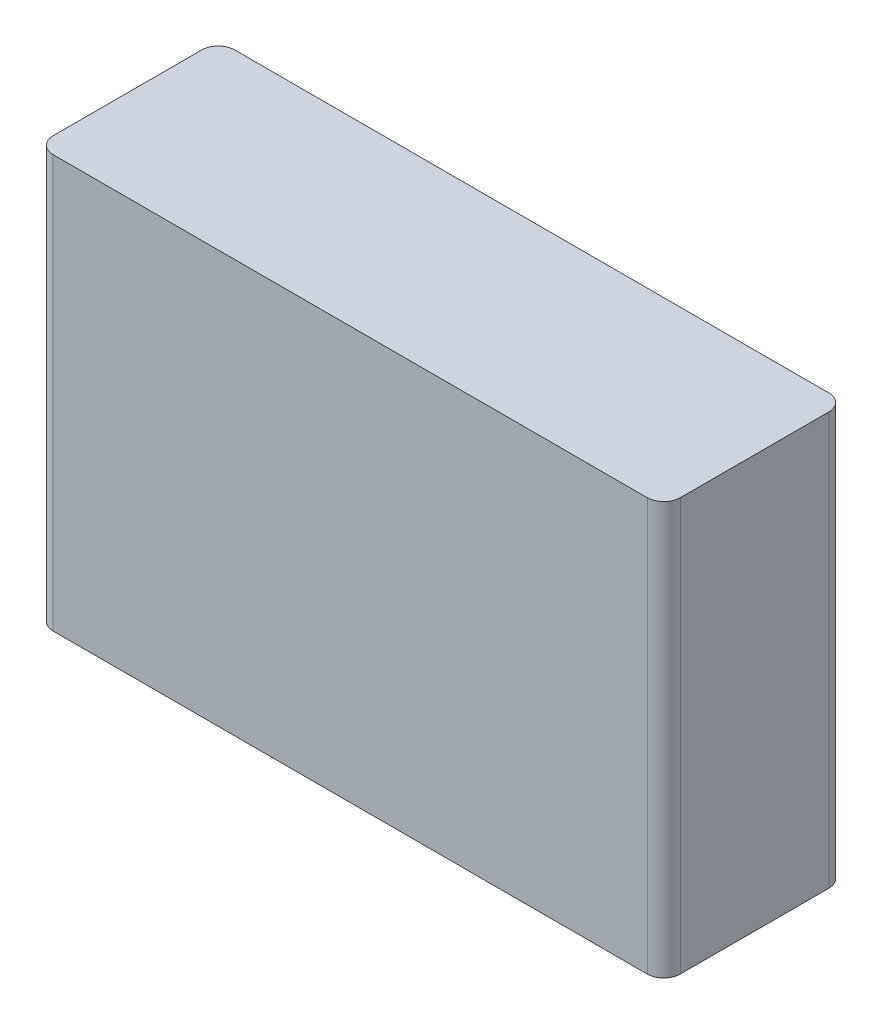
ISO-10303-21;
HEADER;
FILE_DESCRIPTION(('STEP AP214'),'2;1');
FILE_NAME('part.step','',(''),(''),'','','');
FILE_SCHEMA(('AUTOMOTIVE_DESIGN { 1 0 10303 214 1 1 1 1 }'));
ENDSEC;
DATA;
#1=APPLICATION_CONTEXT('core data for automotive mechanical design processes');
#2=APPLICATION_PROTOCOL_DEFINITION('international standard','automotive_design',2000,#1);
#3=PRODUCT_CONTEXT('',#1,'mechanical');
#4=PRODUCT('Part','Part','',(#3));
#5=PRODUCT_RELATED_PRODUCT_CATEGORY('part','',(#4));
#6=PRODUCT_DEFINITION_FORMATION('','',#4);
#7=PRODUCT_DEFINITION_CONTEXT('part definition',#1,'design');
#8=PRODUCT_DEFINITION('design','',#6,#7);
#9=PRODUCT_DEFINITION_SHAPE('','',#8);
#10=(LENGTH_UNIT() NAMED_UNIT(*) SI_UNIT(.MILLI.,.METRE.));
#11=(NAMED_UNIT(*) PLANE_ANGLE_UNIT() SI_UNIT($,.RADIAN.));
#12=(NAMED_UNIT(*) SI_UNIT($,.STERADIAN.) SOLID_ANGLE_UNIT());
#13=UNCERTAINTY_MEASURE_WITH_UNIT(LENGTH_MEASURE(1.E-05),#10,'distance_accuracy_value','');
#14=(GEOMETRIC_REPRESENTATION_CONTEXT(3) GLOBAL_UNCERTAINTY_ASSIGNED_CONTEXT((#13)) GLOBAL_UNIT_ASSIGNED_CONTEXT((#10,
#11,#12)) REPRESENTATION_CONTEXT('',''));
#15=CARTESIAN_POINT('',(0.,0.,0.));
#16=DIRECTION('',(0.,0.,1.));
#17=DIRECTION('',(1.,0.,0.));
#18=AXIS2_PLACEMENT_3D('',#15,#16,#17);
#19=CARTESIAN_POINT('',(-0.9,0.3125,0.55));
#20=DIRECTION('',(0.,-1.,0.));
#21=DIRECTION('',(-0.707106781186548,0.,0.707106781186548));
#22=AXIS2_PLACEMENT_3D('',#19,#20,#21);
#23=CYLINDRICAL_SURFACE('',#22,0.05);
#24=CARTESIAN_POINT('',(-0.9,-0.625,0.55));
#25=DIRECTION('',(0.,1.,0.));
#26=DIRECTION('',(-1.,0.,0.));
#27=AXIS2_PLACEMENT_3D('',#24,#25,#26);
#28=CIRCLE('',#27,0.05);
#29=CARTESIAN_POINT('',(-0.95,-0.625,0.55));
#30=VERTEX_POINT('',#29);
#31=CARTESIAN_POINT('',(-0.9,-0.625,0.6));
#32=VERTEX_POINT('',#31);
#33=EDGE_CURVE('E11',#30,#32,#28,.T.);
#34=ORIENTED_EDGE('',*,*,#33,.T.);
#35=DIRECTION('',(0.,1.,0.));
#36=VECTOR('',#35,1.);
#37=CARTESIAN_POINT('',(-0.9,-0.625,0.6));
#38=LINE('',#37,#36);
#39=CARTESIAN_POINT('',(-0.9,0.625,0.6));
#40=VERTEX_POINT('',#39);
#41=EDGE_CURVE('E144',#32,#40,#38,.T.);
#42=ORIENTED_EDGE('',*,*,#41,.T.);
#43=CARTESIAN_POINT('',(-0.9,0.625,0.55));
#44=DIRECTION('',(0.,-1.,0.));
#45=DIRECTION('',(0.,0.,1.));
#46=AXIS2_PLACEMENT_3D('',#43,#44,#45);
#47=CIRCLE('',#46,0.05);
#48=CARTESIAN_POINT('',(-0.95,0.625,0.55));
#49=VERTEX_POINT('',#48);
#50=EDGE_CURVE('E142',#40,#49,#47,.T.);
#51=ORIENTED_EDGE('',*,*,#50,.T.);
#52=DIRECTION('',(0.,-1.,0.));
#53=VECTOR('',#52,1.);
#54=CARTESIAN_POINT('',(-0.95,0.625,0.55));
#55=LINE('',#54,#53);
#56=EDGE_CURVE('E24',#49,#30,#55,.T.);
#57=ORIENTED_EDGE('',*,*,#56,.T.);
#58=EDGE_LOOP('',(#34,#42,#51,#57));
#59=FACE_BOUND('',#58,.T.);
#60=ADVANCED_FACE('F17',(#59),#23,.T.);
#61=CARTESIAN_POINT('',(-0.95,0.625,0.0500000000000002));
#62=DIRECTION('',(-1.,0.,0.));
#63=DIRECTION('',(0.,0.,1.));
#64=AXIS2_PLACEMENT_3D('',#61,#62,#63);
#65=PLANE('',#64);
#66=ORIENTED_EDGE('',*,*,#56,.F.);
#67=DIRECTION('',(0.,0.,-1.));
#68=VECTOR('',#67,1.);
#69=CARTESIAN_POINT('',(-0.95,0.625,0.55));
#70=LINE('',#69,#68);
#71=CARTESIAN_POINT('',(-0.95,0.625,0.1));
#72=VERTEX_POINT('',#71);
#73=EDGE_CURVE('E140',#49,#72,#70,.T.);
#74=ORIENTED_EDGE('',*,*,#73,.T.);
#75=DIRECTION('',(0.,1.,0.));
#76=VECTOR('',#75,1.);
#77=CARTESIAN_POINT('',(-0.95,-0.625,0.1));
#78=LINE('',#77,#76);
#79=CARTESIAN_POINT('',(-0.95,-0.625,0.1));
#80=VERTEX_POINT('',#79);
#81=EDGE_CURVE('E132',#80,#72,#78,.T.);
#82=ORIENTED_EDGE('',*,*,#81,.F.);
#83=DIRECTION('',(0.,0.,1.));
#84=VECTOR('',#83,1.);
#85=CARTESIAN_POINT('',(-0.95,-0.625,0.1));
#86=LINE('',#85,#84);
#87=EDGE_CURVE('E126',#80,#30,#86,.T.);
#88=ORIENTED_EDGE('',*,*,#87,.T.);
#89=EDGE_LOOP('',(#66,#74,#82,#88));
#90=FACE_BOUND('',#89,.T.);
#91=ADVANCED_FACE('F148',(#90),#65,.T.);
#92=CARTESIAN_POINT('',(1.,0.625,0.));
#93=DIRECTION('',(0.,1.,0.));
#94=DIRECTION('',(-1.,0.,0.));
#95=AXIS2_PLACEMENT_3D('',#92,#93,#94);
#96=PLANE('',#95);
#97=ORIENTED_EDGE('',*,*,#50,.F.);
#98=DIRECTION('',(-1.,0.,0.));
#99=VECTOR('',#98,1.);
#100=CARTESIAN_POINT('',(0.9,0.625,0.6));
#101=LINE('',#100,#99);
#102=CARTESIAN_POINT('',(0.9,0.625,0.6));
#103=VERTEX_POINT('',#102);
#104=EDGE_CURVE('E135',#103,#40,#101,.T.);
#105=ORIENTED_EDGE('',*,*,#104,.F.);
#106=CARTESIAN_POINT('',(0.9,0.625,0.55));
#107=DIRECTION('',(0.,-1.,0.));
#108=DIRECTION('',(1.,0.,0.));
#109=AXIS2_PLACEMENT_3D('',#106,#107,#108);
#110=CIRCLE('',#109,0.05);
#111=CARTESIAN_POINT('',(0.95,0.625,0.55));
#112=VERTEX_POINT('',#111);
#113=EDGE_CURVE('E128',#112,#103,#110,.T.);
#114=ORIENTED_EDGE('',*,*,#113,.F.);
#115=DIRECTION('',(0.,0.,1.));
#116=VECTOR('',#115,1.);
#117=CARTESIAN_POINT('',(0.95,0.625,0.1));
#118=LINE('',#117,#116);
#119=CARTESIAN_POINT('',(0.95,0.625,0.1));
#120=VERTEX_POINT('',#119);
#121=EDGE_CURVE('E87',#120,#112,#118,.T.);
#122=ORIENTED_EDGE('',*,*,#121,.F.);
#123=CARTESIAN_POINT('',(0.9,0.625,0.1));
#124=DIRECTION('',(0.,-1.,0.));
#125=DIRECTION('',(0.,0.,-1.));
#126=AXIS2_PLACEMENT_3D('',#123,#124,#125);
#127=CIRCLE('',#126,0.05);
#128=CARTESIAN_POINT('',(0.9,0.625,0.0499999999999998));
#129=VERTEX_POINT('',#128);
#130=EDGE_CURVE('E124',#129,#120,#127,.T.);
#131=ORIENTED_EDGE('',*,*,#130,.F.);
#132=DIRECTION('',(1.,0.,0.));
#133=VECTOR('',#132,1.);
#134=CARTESIAN_POINT('',(-0.9,0.625,0.0500000000000002));
#135=LINE('',#134,#133);
#136=CARTESIAN_POINT('',(-0.9,0.625,0.0500000000000002));
#137=VERTEX_POINT('',#136);
#138=EDGE_CURVE('E122',#137,#129,#135,.T.);
#139=ORIENTED_EDGE('',*,*,#138,.F.);
#140=CARTESIAN_POINT('',(-0.9,0.625,0.1));
#141=DIRECTION('',(0.,-1.,0.));
#142=DIRECTION('',(-1.,0.,0.));
#143=AXIS2_PLACEMENT_3D('',#140,#141,#142);
#144=CIRCLE('',#143,0.05);
#145=EDGE_CURVE('E138',#72,#137,#144,.T.);
#146=ORIENTED_EDGE('',*,*,#145,.F.);
#147=ORIENTED_EDGE('',*,*,#73,.F.);
#148=EDGE_LOOP('',(#97,#105,#114,#122,#131,#139,#146,#147));
#149=FACE_BOUND('',#148,.T.);
#150=ADVANCED_FACE('F153',(#149),#96,.T.);
#151=CARTESIAN_POINT('',(-0.9,0.3125,0.1));
#152=DIRECTION('',(0.,1.,0.));
#153=DIRECTION('',(-0.707106781186548,0.,-0.707106781186547));
#154=AXIS2_PLACEMENT_3D('',#151,#152,#153);
#155=CYLINDRICAL_SURFACE('',#154,0.05);
#156=ORIENTED_EDGE('',*,*,#145,.T.);
#157=DIRECTION('',(0.,-1.,0.));
#158=VECTOR('',#157,1.);
#159=CARTESIAN_POINT('',(-0.9,0.625,0.05));
#160=LINE('',#159,#158);
#161=CARTESIAN_POINT('',(-0.9,-0.625,0.0500000000000002));
#162=VERTEX_POINT('',#161);
#163=EDGE_CURVE('E130',#137,#162,#160,.T.);
#164=ORIENTED_EDGE('',*,*,#163,.T.);
#165=CARTESIAN_POINT('',(-0.9,-0.625,0.1));
#166=DIRECTION('',(0.,1.,0.));
#167=DIRECTION('',(0.,0.,-1.));
#168=AXIS2_PLACEMENT_3D('',#165,#166,#167);
#169=CIRCLE('',#168,0.05);
#170=EDGE_CURVE('E119',#162,#80,#169,.T.);
#171=ORIENTED_EDGE('',*,*,#170,.T.);
#172=ORIENTED_EDGE('',*,*,#81,.T.);
#173=EDGE_LOOP('',(#156,#164,#171,#172));
#174=FACE_BOUND('',#173,.T.);
#175=ADVANCED_FACE('F157',(#174),#155,.T.);
#176=CARTESIAN_POINT('',(0.,0.,0.05));
#177=DIRECTION('',(0.,0.,1.));
#178=DIRECTION('',(1.,0.,0.));
#179=AXIS2_PLACEMENT_3D('',#176,#177,#178);
#180=PLANE('',#179);
#181=ORIENTED_EDGE('',*,*,#163,.F.);
#182=ORIENTED_EDGE('',*,*,#138,.T.);
#183=DIRECTION('',(0.,1.,0.));
#184=VECTOR('',#183,1.);
#185=CARTESIAN_POINT('',(0.9,-0.625,0.05));
#186=LINE('',#185,#184);
#187=CARTESIAN_POINT('',(0.9,-0.625,0.0499999999999998));
#188=VERTEX_POINT('',#187);
#189=EDGE_CURVE('E113',#188,#129,#186,.T.);
#190=ORIENTED_EDGE('',*,*,#189,.F.);
#191=DIRECTION('',(-1.,0.,0.));
#192=VECTOR('',#191,1.);
#193=CARTESIAN_POINT('',(0.9,-0.625,0.0499999999999998));
#194=LINE('',#193,#192);
#195=EDGE_CURVE('E109',#188,#162,#194,.T.);
#196=ORIENTED_EDGE('',*,*,#195,.T.);
#197=EDGE_LOOP('',(#181,#182,#190,#196));
#198=FACE_BOUND('',#197,.T.);
#199=ADVANCED_FACE('F160',(#198),#180,.F.);
#200=CARTESIAN_POINT('',(0.9,0.3125,0.1));
#201=DIRECTION('',(0.,1.,0.));
#202=DIRECTION('',(0.707106781186548,0.,-0.707106781186547));
#203=AXIS2_PLACEMENT_3D('',#200,#201,#202);
#204=CYLINDRICAL_SURFACE('',#203,0.05);
#205=ORIENTED_EDGE('',*,*,#130,.T.);
#206=DIRECTION('',(0.,-1.,0.));
#207=VECTOR('',#206,1.);
#208=CARTESIAN_POINT('',(0.95,0.625,0.1));
#209=LINE('',#208,#207);
#210=CARTESIAN_POINT('',(0.95,-0.625,0.1));
#211=VERTEX_POINT('',#210);
#212=EDGE_CURVE('E116',#120,#211,#209,.T.);
#213=ORIENTED_EDGE('',*,*,#212,.T.);
#214=CARTESIAN_POINT('',(0.9,-0.625,0.1));
#215=DIRECTION('',(0.,1.,0.));
#216=DIRECTION('',(1.,0.,0.));
#217=AXIS2_PLACEMENT_3D('',#214,#215,#216);
#218=CIRCLE('',#217,0.05);
#219=EDGE_CURVE('E103',#211,#188,#218,.T.);
#220=ORIENTED_EDGE('',*,*,#219,.T.);
#221=ORIENTED_EDGE('',*,*,#189,.T.);
#222=EDGE_LOOP('',(#205,#213,#220,#221));
#223=FACE_BOUND('',#222,.T.);
#224=ADVANCED_FACE('F163',(#223),#204,.T.);
#225=CARTESIAN_POINT('',(0.95,0.625,0.6));
#226=DIRECTION('',(1.,0.,0.));
#227=DIRECTION('',(0.,0.,-1.));
#228=AXIS2_PLACEMENT_3D('',#225,#226,#227);
#229=PLANE('',#228);
#230=ORIENTED_EDGE('',*,*,#212,.F.);
#231=ORIENTED_EDGE('',*,*,#121,.T.);
#232=DIRECTION('',(0.,1.,0.));
#233=VECTOR('',#232,1.);
#234=CARTESIAN_POINT('',(0.95,-0.625,0.55));
#235=LINE('',#234,#233);
#236=CARTESIAN_POINT('',(0.95,-0.625,0.55));
#237=VERTEX_POINT('',#236);
#238=EDGE_CURVE('E79',#237,#112,#235,.T.);
#239=ORIENTED_EDGE('',*,*,#238,.F.);
#240=DIRECTION('',(0.,0.,-1.));
#241=VECTOR('',#240,1.);
#242=CARTESIAN_POINT('',(0.95,-0.625,0.55));
#243=LINE('',#242,#241);
#244=EDGE_CURVE('E84',#237,#211,#243,.T.);
#245=ORIENTED_EDGE('',*,*,#244,.T.);
#246=EDGE_LOOP('',(#230,#231,#239,#245));
#247=FACE_BOUND('',#246,.T.);
#248=ADVANCED_FACE('F82',(#247),#229,.T.);
#249=CARTESIAN_POINT('',(0.9,0.3125,0.55));
#250=DIRECTION('',(0.,1.,0.));
#251=DIRECTION('',(0.707106781186548,0.,0.707106781186548));
#252=AXIS2_PLACEMENT_3D('',#249,#250,#251);
#253=CYLINDRICAL_SURFACE('',#252,0.05);
#254=ORIENTED_EDGE('',*,*,#113,.T.);
#255=DIRECTION('',(0.,-1.,0.));
#256=VECTOR('',#255,1.);
#257=CARTESIAN_POINT('',(0.9,0.625,0.6));
#258=LINE('',#257,#256);
#259=CARTESIAN_POINT('',(0.9,-0.625,0.6));
#260=VERTEX_POINT('',#259);
#261=EDGE_CURVE('E90',#103,#260,#258,.T.);
#262=ORIENTED_EDGE('',*,*,#261,.T.);
#263=CARTESIAN_POINT('',(0.9,-0.625,0.55));
#264=DIRECTION('',(0.,1.,0.));
#265=DIRECTION('',(0.,0.,1.));
#266=AXIS2_PLACEMENT_3D('',#263,#264,#265);
#267=CIRCLE('',#266,0.05);
#268=EDGE_CURVE('E91',#260,#237,#267,.T.);
#269=ORIENTED_EDGE('',*,*,#268,.T.);
#270=ORIENTED_EDGE('',*,*,#238,.T.);
#271=EDGE_LOOP('',(#254,#262,#269,#270));
#272=FACE_BOUND('',#271,.T.);
#273=ADVANCED_FACE('F94',(#272),#253,.T.);
#274=CARTESIAN_POINT('',(-1.,-0.625,0.));
#275=DIRECTION('',(0.,-1.,0.));
#276=DIRECTION('',(1.,0.,0.));
#277=AXIS2_PLACEMENT_3D('',#274,#275,#276);
#278=PLANE('',#277);
#279=ORIENTED_EDGE('',*,*,#33,.F.);
#280=ORIENTED_EDGE('',*,*,#87,.F.);
#281=ORIENTED_EDGE('',*,*,#170,.F.);
#282=ORIENTED_EDGE('',*,*,#195,.F.);
#283=ORIENTED_EDGE('',*,*,#219,.F.);
#284=ORIENTED_EDGE('',*,*,#244,.F.);
#285=ORIENTED_EDGE('',*,*,#268,.F.);
#286=DIRECTION('',(1.,0.,0.));
#287=VECTOR('',#286,1.);
#288=CARTESIAN_POINT('',(-0.9,-0.625,0.6));
#289=LINE('',#288,#287);
#290=EDGE_CURVE('E104',#32,#260,#289,.T.);
#291=ORIENTED_EDGE('',*,*,#290,.F.);
#292=EDGE_LOOP('',(#279,#280,#281,#282,#283,#284,#285,#291));
#293=FACE_BOUND('',#292,.T.);
#294=ADVANCED_FACE('F100',(#293),#278,.T.);
#295=CARTESIAN_POINT('',(0.,0.,0.6));
#296=DIRECTION('',(0.,0.,-1.));
#297=DIRECTION('',(-1.,0.,0.));
#298=AXIS2_PLACEMENT_3D('',#295,#296,#297);
#299=PLANE('',#298);
#300=ORIENTED_EDGE('',*,*,#41,.F.);
#301=ORIENTED_EDGE('',*,*,#290,.T.);
#302=ORIENTED_EDGE('',*,*,#261,.F.);
#303=ORIENTED_EDGE('',*,*,#104,.T.);
#304=EDGE_LOOP('',(#300,#301,#302,#303));
#305=FACE_BOUND('',#304,.T.);
#306=ADVANCED_FACE('F151',(#305),#299,.F.);
#307=CLOSED_SHELL('',(#60,#91,#150,#175,#199,#224,#248,#273,#294,#306));
#308=MANIFOLD_SOLID_BREP('B1',#307);
#309=ADVANCED_BREP_SHAPE_REPRESENTATION('',(#18,#308),#14);
#310=SHAPE_DEFINITION_REPRESENTATION(#9,#309);
ENDSEC;
END-ISO-10303-21;
